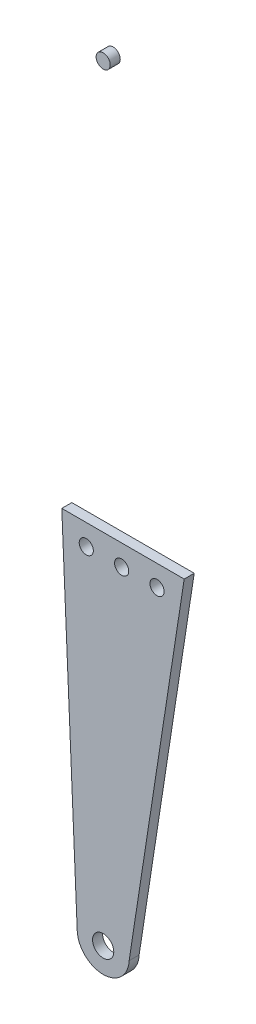
ISO-10303-21;
HEADER;
FILE_DESCRIPTION(('STEP AP214'),'2;1');
FILE_NAME('part.step','',(''),(''),'','','');
FILE_SCHEMA(('AUTOMOTIVE_DESIGN { 1 0 10303 214 1 1 1 1 }'));
ENDSEC;
DATA;
#1=APPLICATION_CONTEXT('core data for automotive mechanical design processes');
#2=APPLICATION_PROTOCOL_DEFINITION('international standard','automotive_design',2000,#1);
#3=PRODUCT_CONTEXT('',#1,'mechanical');
#4=PRODUCT('Part','Part','',(#3));
#5=PRODUCT_RELATED_PRODUCT_CATEGORY('part','',(#4));
#6=PRODUCT_DEFINITION_FORMATION('','',#4);
#7=PRODUCT_DEFINITION_CONTEXT('part definition',#1,'design');
#8=PRODUCT_DEFINITION('design','',#6,#7);
#9=PRODUCT_DEFINITION_SHAPE('','',#8);
#10=(LENGTH_UNIT() NAMED_UNIT(*) SI_UNIT(.MILLI.,.METRE.));
#11=(NAMED_UNIT(*) PLANE_ANGLE_UNIT() SI_UNIT($,.RADIAN.));
#12=(NAMED_UNIT(*) SI_UNIT($,.STERADIAN.) SOLID_ANGLE_UNIT());
#13=UNCERTAINTY_MEASURE_WITH_UNIT(LENGTH_MEASURE(1.E-05),#10,'distance_accuracy_value','');
#14=(GEOMETRIC_REPRESENTATION_CONTEXT(3) GLOBAL_UNCERTAINTY_ASSIGNED_CONTEXT((#13)) GLOBAL_UNIT_ASSIGNED_CONTEXT((#10,
#11,#12)) REPRESENTATION_CONTEXT('',''));
#15=CARTESIAN_POINT('',(0.,0.,0.));
#16=DIRECTION('',(0.,0.,1.));
#17=DIRECTION('',(1.,0.,0.));
#18=AXIS2_PLACEMENT_3D('',#15,#16,#17);
#19=CARTESIAN_POINT('',(58.9104803708938,262.917677391953,174.766033879968));
#20=DIRECTION('',(0.,0.,-1.));
#21=DIRECTION('',(-1.,0.,0.));
#22=AXIS2_PLACEMENT_3D('',#19,#20,#21);
#23=CYLINDRICAL_SURFACE('',#22,3.);
#24=CARTESIAN_POINT('',(58.9104803708938,262.917677391953,0.));
#25=DIRECTION('',(0.,0.,1.));
#26=DIRECTION('',(1.,0.,0.));
#27=AXIS2_PLACEMENT_3D('',#24,#25,#26);
#28=CIRCLE('',#27,3.);
#29=CARTESIAN_POINT('',(61.9104803708938,262.917677391953,0.));
#30=VERTEX_POINT('',#29);
#31=EDGE_CURVE('E48',#30,#30,#28,.T.);
#32=ORIENTED_EDGE('',*,*,#31,.T.);
#33=EDGE_LOOP('',(#32));
#34=FACE_BOUND('',#33,.T.);
#35=CARTESIAN_POINT('',(58.9104803708938,262.917677391953,4.25000000000003));
#36=DIRECTION('',(0.,0.,1.));
#37=DIRECTION('',(1.,0.,0.));
#38=AXIS2_PLACEMENT_3D('',#35,#36,#37);
#39=CIRCLE('',#38,3.);
#40=CARTESIAN_POINT('',(61.9104803708938,262.917677391953,4.25000000000003));
#41=VERTEX_POINT('',#40);
#42=EDGE_CURVE('E11',#41,#41,#39,.T.);
#43=ORIENTED_EDGE('',*,*,#42,.F.);
#44=EDGE_LOOP('',(#43));
#45=FACE_BOUND('',#44,.T.);
#46=ADVANCED_FACE('F41',(#34,#45),#23,.T.);
#47=CARTESIAN_POINT('',(58.9104803708938,262.917677391953,0.));
#48=DIRECTION('',(0.,0.,1.));
#49=DIRECTION('',(1.,0.,0.));
#50=AXIS2_PLACEMENT_3D('',#47,#48,#49);
#51=PLANE('',#50);
#52=ORIENTED_EDGE('',*,*,#31,.F.);
#53=EDGE_LOOP('',(#52));
#54=FACE_BOUND('',#53,.T.);
#55=ADVANCED_FACE('F56',(#54),#51,.F.);
#56=CARTESIAN_POINT('',(58.9104803708938,242.917677391945,4.25000000000003));
#57=DIRECTION('',(0.,0.,1.));
#58=DIRECTION('',(1.,0.,0.));
#59=AXIS2_PLACEMENT_3D('',#56,#57,#58);
#60=PLANE('',#59);
#61=ORIENTED_EDGE('',*,*,#42,.T.);
#62=EDGE_LOOP('',(#61));
#63=FACE_BOUND('',#62,.T.);
#64=ADVANCED_FACE('F43',(#63),#60,.T.);
#65=CLOSED_SHELL('',(#46,#55,#64));
#66=MANIFOLD_SOLID_BREP('B2',#65);
#67=CARTESIAN_POINT('',(93.2727340553119,89.8031267411093,174.766033879968));
#68=DIRECTION('',(-0.988376331409149,0.152027061769254,0.));
#69=DIRECTION('',(-0.152027061769254,-0.988376331409149,0.));
#70=AXIS2_PLACEMENT_3D('',#67,#68,#69);
#71=PLANE('',#70);
#72=DIRECTION('',(0.152027061769254,0.988376331409149,0.));
#73=VECTOR('',#72,1.);
#74=CARTESIAN_POINT('',(93.2727340553119,89.8031267411093,4.25000000000003));
#75=LINE('',#74,#73);
#76=CARTESIAN_POINT('',(69.9104803708938,-62.0823226080471,4.25000000000003));
#77=VERTEX_POINT('',#76);
#78=CARTESIAN_POINT('',(93.2727340553119,89.8031267411093,4.25000000000003));
#79=VERTEX_POINT('',#78);
#80=EDGE_CURVE('E126',#77,#79,#75,.T.);
#81=ORIENTED_EDGE('',*,*,#80,.F.);
#82=DIRECTION('',(0.,0.,-1.));
#83=VECTOR('',#82,1.);
#84=CARTESIAN_POINT('',(69.9104803708938,-62.0823226080471,174.766033879968));
#85=LINE('',#84,#83);
#86=CARTESIAN_POINT('',(69.9104803708938,-62.0823226080471,0.));
#87=VERTEX_POINT('',#86);
#88=EDGE_CURVE('E98',#77,#87,#85,.T.);
#89=ORIENTED_EDGE('',*,*,#88,.T.);
#90=DIRECTION('',(0.152027061769254,0.988376331409149,0.));
#91=VECTOR('',#90,1.);
#92=CARTESIAN_POINT('',(93.2727340553119,89.8031267411093,0.));
#93=LINE('',#92,#91);
#94=CARTESIAN_POINT('',(93.2727340553119,89.8031267411093,0.));
#95=VERTEX_POINT('',#94);
#96=EDGE_CURVE('E129',#87,#95,#93,.T.);
#97=ORIENTED_EDGE('',*,*,#96,.T.);
#98=DIRECTION('',(0.,0.,-1.));
#99=VECTOR('',#98,1.);
#100=CARTESIAN_POINT('',(93.2727340553119,89.8031267411093,174.766033879968));
#101=LINE('',#100,#99);
#102=EDGE_CURVE('E123',#79,#95,#101,.T.);
#103=ORIENTED_EDGE('',*,*,#102,.F.);
#104=EDGE_LOOP('',(#81,#89,#97,#103));
#105=FACE_BOUND('',#104,.T.);
#106=ADVANCED_FACE('F82',(#105),#71,.F.);
#107=CARTESIAN_POINT('',(58.9104803708938,-61.6078128041255,174.766033879968));
#108=DIRECTION('',(0.,0.,-1.));
#109=DIRECTION('',(-1.,0.,0.));
#110=AXIS2_PLACEMENT_3D('',#107,#108,#109);
#111=CYLINDRICAL_SURFACE('',#110,11.010229768448);
#112=CARTESIAN_POINT('',(58.9104803708938,-61.6078128041255,4.25000000000003));
#113=DIRECTION('',(0.,0.,1.));
#114=DIRECTION('',(1.,0.,0.));
#115=AXIS2_PLACEMENT_3D('',#112,#113,#114);
#116=CIRCLE('',#115,11.010229768448);
#117=CARTESIAN_POINT('',(47.9104803708938,-62.0823226080471,4.25000000000003));
#118=VERTEX_POINT('',#117);
#119=EDGE_CURVE('E140',#118,#77,#116,.T.);
#120=ORIENTED_EDGE('',*,*,#119,.F.);
#121=DIRECTION('',(0.,0.,-1.));
#122=VECTOR('',#121,1.);
#123=CARTESIAN_POINT('',(47.9104803708938,-62.0823226080471,174.766033879968));
#124=LINE('',#123,#122);
#125=CARTESIAN_POINT('',(47.9104803708938,-62.0823226080471,0.));
#126=VERTEX_POINT('',#125);
#127=EDGE_CURVE('E91',#118,#126,#124,.T.);
#128=ORIENTED_EDGE('',*,*,#127,.T.);
#129=CARTESIAN_POINT('',(58.9104803708938,-61.6078128041255,0.));
#130=DIRECTION('',(0.,0.,1.));
#131=DIRECTION('',(1.,0.,0.));
#132=AXIS2_PLACEMENT_3D('',#129,#130,#131);
#133=CIRCLE('',#132,11.010229768448);
#134=EDGE_CURVE('E156',#126,#87,#133,.T.);
#135=ORIENTED_EDGE('',*,*,#134,.T.);
#136=ORIENTED_EDGE('',*,*,#88,.F.);
#137=EDGE_LOOP('',(#120,#128,#135,#136));
#138=FACE_BOUND('',#137,.T.);
#139=ADVANCED_FACE('F160',(#138),#111,.T.);
#140=CARTESIAN_POINT('',(41.3585590264204,89.8031267411093,174.766033879968));
#141=DIRECTION('',(0.999070885107477,0.043097175436009,0.));
#142=DIRECTION('',(-0.043097175436009,0.999070885107477,0.));
#143=AXIS2_PLACEMENT_3D('',#140,#141,#142);
#144=PLANE('',#143);
#145=DIRECTION('',(0.043097175436009,-0.999070885107477,0.));
#146=VECTOR('',#145,1.);
#147=CARTESIAN_POINT('',(41.3585590264204,89.8031267411093,4.25000000000003));
#148=LINE('',#147,#146);
#149=CARTESIAN_POINT('',(41.3585590264204,89.8031267411093,4.25000000000003));
#150=VERTEX_POINT('',#149);
#151=EDGE_CURVE('E105',#150,#118,#148,.T.);
#152=ORIENTED_EDGE('',*,*,#151,.F.);
#153=DIRECTION('',(0.,0.,-1.));
#154=VECTOR('',#153,1.);
#155=CARTESIAN_POINT('',(41.3585590264204,89.8031267411093,174.766033879968));
#156=LINE('',#155,#154);
#157=CARTESIAN_POINT('',(41.3585590264204,89.8031267411093,0.));
#158=VERTEX_POINT('',#157);
#159=EDGE_CURVE('E39',#150,#158,#156,.T.);
#160=ORIENTED_EDGE('',*,*,#159,.T.);
#161=DIRECTION('',(0.043097175436009,-0.999070885107477,0.));
#162=VECTOR('',#161,1.);
#163=CARTESIAN_POINT('',(41.3585590264204,89.8031267411093,0.));
#164=LINE('',#163,#162);
#165=EDGE_CURVE('E153',#158,#126,#164,.T.);
#166=ORIENTED_EDGE('',*,*,#165,.T.);
#167=ORIENTED_EDGE('',*,*,#127,.F.);
#168=EDGE_LOOP('',(#152,#160,#166,#167));
#169=FACE_BOUND('',#168,.T.);
#170=ADVANCED_FACE('F163',(#169),#144,.F.);
#171=CARTESIAN_POINT('',(41.3585590264204,89.8031267411093,174.766033879968));
#172=DIRECTION('',(0.,-1.,0.));
#173=DIRECTION('',(0.,0.,-1.));
#174=AXIS2_PLACEMENT_3D('',#171,#172,#173);
#175=PLANE('',#174);
#176=DIRECTION('',(-1.,0.,0.));
#177=VECTOR('',#176,1.);
#178=CARTESIAN_POINT('',(41.3585590264204,89.8031267411093,4.25000000000003));
#179=LINE('',#178,#177);
#180=EDGE_CURVE('E135',#79,#150,#179,.T.);
#181=ORIENTED_EDGE('',*,*,#180,.F.);
#182=ORIENTED_EDGE('',*,*,#102,.T.);
#183=DIRECTION('',(-1.,0.,0.));
#184=VECTOR('',#183,1.);
#185=CARTESIAN_POINT('',(41.3585590264204,89.8031267411093,0.));
#186=LINE('',#185,#184);
#187=EDGE_CURVE('E151',#95,#158,#186,.T.);
#188=ORIENTED_EDGE('',*,*,#187,.T.);
#189=ORIENTED_EDGE('',*,*,#159,.F.);
#190=EDGE_LOOP('',(#181,#182,#188,#189));
#191=FACE_BOUND('',#190,.T.);
#192=ADVANCED_FACE('F84',(#191),#175,.F.);
#193=CARTESIAN_POINT('',(58.9104803708938,-61.6078128041255,0.));
#194=DIRECTION('',(0.,0.,1.));
#195=DIRECTION('',(1.,0.,0.));
#196=AXIS2_PLACEMENT_3D('',#193,#194,#195);
#197=PLANE('',#196);
#198=CARTESIAN_POINT('',(51.7511527094115,80.9176773919431,0.));
#199=DIRECTION('',(0.,0.,1.));
#200=DIRECTION('',(1.,0.,0.));
#201=AXIS2_PLACEMENT_3D('',#198,#199,#200);
#202=CIRCLE('',#201,3.);
#203=CARTESIAN_POINT('',(54.7511527094115,80.9176773919431,0.));
#204=VERTEX_POINT('',#203);
#205=EDGE_CURVE('E144',#204,#204,#202,.T.);
#206=ORIENTED_EDGE('',*,*,#205,.T.);
#207=EDGE_LOOP('',(#206));
#208=FACE_BOUND('',#207,.T.);
#209=CARTESIAN_POINT('',(66.7511527094115,80.9176773919431,0.));
#210=DIRECTION('',(0.,0.,1.));
#211=DIRECTION('',(1.,0.,0.));
#212=AXIS2_PLACEMENT_3D('',#209,#210,#211);
#213=CIRCLE('',#212,2.99999999999999);
#214=CARTESIAN_POINT('',(69.7511527094115,80.9176773919431,0.));
#215=VERTEX_POINT('',#214);
#216=EDGE_CURVE('E250',#215,#215,#213,.T.);
#217=ORIENTED_EDGE('',*,*,#216,.T.);
#218=EDGE_LOOP('',(#217));
#219=FACE_BOUND('',#218,.T.);
#220=CARTESIAN_POINT('',(81.7511527094115,80.9176773919431,0.));
#221=DIRECTION('',(0.,0.,1.));
#222=DIRECTION('',(1.,0.,0.));
#223=AXIS2_PLACEMENT_3D('',#220,#221,#222);
#224=CIRCLE('',#223,3.00000000000001);
#225=CARTESIAN_POINT('',(84.7511527094115,80.9176773919431,0.));
#226=VERTEX_POINT('',#225);
#227=EDGE_CURVE('E252',#226,#226,#224,.T.);
#228=ORIENTED_EDGE('',*,*,#227,.T.);
#229=EDGE_LOOP('',(#228));
#230=FACE_BOUND('',#229,.T.);
#231=ORIENTED_EDGE('',*,*,#187,.F.);
#232=ORIENTED_EDGE('',*,*,#96,.F.);
#233=ORIENTED_EDGE('',*,*,#134,.F.);
#234=ORIENTED_EDGE('',*,*,#165,.F.);
#235=EDGE_LOOP('',(#231,#232,#233,#234));
#236=FACE_BOUND('',#235,.T.);
#237=CARTESIAN_POINT('',(58.9104803708938,-62.0823226080471,0.));
#238=DIRECTION('',(0.,0.,1.));
#239=DIRECTION('',(1.,0.,0.));
#240=AXIS2_PLACEMENT_3D('',#237,#238,#239);
#241=CIRCLE('',#240,4.50000000000001);
#242=CARTESIAN_POINT('',(63.4104803708938,-62.0823226080471,0.));
#243=VERTEX_POINT('',#242);
#244=EDGE_CURVE('E137',#243,#243,#241,.T.);
#245=ORIENTED_EDGE('',*,*,#244,.T.);
#246=EDGE_LOOP('',(#245));
#247=FACE_BOUND('',#246,.T.);
#248=ADVANCED_FACE('F165',(#208,#219,#230,#236,#247),#197,.F.);
#249=CARTESIAN_POINT('',(58.9104803708938,-62.0823226080471,174.766033879968));
#250=DIRECTION('',(0.,0.,-1.));
#251=DIRECTION('',(-1.,0.,0.));
#252=AXIS2_PLACEMENT_3D('',#249,#250,#251);
#253=CYLINDRICAL_SURFACE('',#252,4.50000000000001);
#254=ORIENTED_EDGE('',*,*,#244,.F.);
#255=EDGE_LOOP('',(#254));
#256=FACE_BOUND('',#255,.T.);
#257=CARTESIAN_POINT('',(58.9104803708938,-62.0823226080471,4.25000000000003));
#258=DIRECTION('',(0.,0.,1.));
#259=DIRECTION('',(1.,0.,0.));
#260=AXIS2_PLACEMENT_3D('',#257,#258,#259);
#261=CIRCLE('',#260,4.50000000000001);
#262=CARTESIAN_POINT('',(63.4104803708938,-62.0823226080471,4.25000000000003));
#263=VERTEX_POINT('',#262);
#264=EDGE_CURVE('E86',#263,#263,#261,.T.);
#265=ORIENTED_EDGE('',*,*,#264,.T.);
#266=EDGE_LOOP('',(#265));
#267=FACE_BOUND('',#266,.T.);
#268=ADVANCED_FACE('F168',(#256,#267),#253,.F.);
#269=CARTESIAN_POINT('',(58.9104803708938,242.917677391945,4.25000000000003));
#270=DIRECTION('',(0.,0.,1.));
#271=DIRECTION('',(1.,0.,0.));
#272=AXIS2_PLACEMENT_3D('',#269,#270,#271);
#273=PLANE('',#272);
#274=CARTESIAN_POINT('',(51.7511527094115,80.9176773919431,4.25000000000003));
#275=DIRECTION('',(0.,0.,1.));
#276=DIRECTION('',(1.,0.,0.));
#277=AXIS2_PLACEMENT_3D('',#274,#275,#276);
#278=CIRCLE('',#277,3.);
#279=CARTESIAN_POINT('',(54.7511527094115,80.9176773919431,4.25000000000003));
#280=VERTEX_POINT('',#279);
#281=EDGE_CURVE('E247',#280,#280,#278,.T.);
#282=ORIENTED_EDGE('',*,*,#281,.F.);
#283=EDGE_LOOP('',(#282));
#284=FACE_BOUND('',#283,.T.);
#285=CARTESIAN_POINT('',(66.7511527094115,80.9176773919431,4.25000000000003));
#286=DIRECTION('',(0.,0.,1.));
#287=DIRECTION('',(1.,0.,0.));
#288=AXIS2_PLACEMENT_3D('',#285,#286,#287);
#289=CIRCLE('',#288,2.99999999999999);
#290=CARTESIAN_POINT('',(69.7511527094115,80.9176773919431,4.25000000000003));
#291=VERTEX_POINT('',#290);
#292=EDGE_CURVE('E261',#291,#291,#289,.T.);
#293=ORIENTED_EDGE('',*,*,#292,.F.);
#294=EDGE_LOOP('',(#293));
#295=FACE_BOUND('',#294,.T.);
#296=CARTESIAN_POINT('',(81.7511527094115,80.9176773919431,4.25000000000003));
#297=DIRECTION('',(0.,0.,1.));
#298=DIRECTION('',(1.,0.,0.));
#299=AXIS2_PLACEMENT_3D('',#296,#297,#298);
#300=CIRCLE('',#299,3.00000000000001);
#301=CARTESIAN_POINT('',(84.7511527094115,80.9176773919431,4.25000000000003));
#302=VERTEX_POINT('',#301);
#303=EDGE_CURVE('E258',#302,#302,#300,.T.);
#304=ORIENTED_EDGE('',*,*,#303,.F.);
#305=EDGE_LOOP('',(#304));
#306=FACE_BOUND('',#305,.T.);
#307=ORIENTED_EDGE('',*,*,#264,.F.);
#308=EDGE_LOOP('',(#307));
#309=FACE_BOUND('',#308,.T.);
#310=ORIENTED_EDGE('',*,*,#80,.T.);
#311=ORIENTED_EDGE('',*,*,#180,.T.);
#312=ORIENTED_EDGE('',*,*,#151,.T.);
#313=ORIENTED_EDGE('',*,*,#119,.T.);
#314=EDGE_LOOP('',(#310,#311,#312,#313));
#315=FACE_BOUND('',#314,.T.);
#316=ADVANCED_FACE('F139',(#284,#295,#306,#309,#315),#273,.T.);
#317=CARTESIAN_POINT('',(81.7511527094115,80.9176773919431,-5.74999999999997));
#318=DIRECTION('',(0.,0.,1.));
#319=DIRECTION('',(1.,0.,0.));
#320=AXIS2_PLACEMENT_3D('',#317,#318,#319);
#321=CYLINDRICAL_SURFACE('',#320,3.00000000000001);
#322=ORIENTED_EDGE('',*,*,#303,.T.);
#323=EDGE_LOOP('',(#322));
#324=FACE_BOUND('',#323,.T.);
#325=ORIENTED_EDGE('',*,*,#227,.F.);
#326=EDGE_LOOP('',(#325));
#327=FACE_BOUND('',#326,.T.);
#328=ADVANCED_FACE('F179',(#324,#327),#321,.F.);
#329=CARTESIAN_POINT('',(66.7511527094115,80.9176773919431,-5.74999999999997));
#330=DIRECTION('',(0.,0.,1.));
#331=DIRECTION('',(1.,0.,0.));
#332=AXIS2_PLACEMENT_3D('',#329,#330,#331);
#333=CYLINDRICAL_SURFACE('',#332,2.99999999999999);
#334=ORIENTED_EDGE('',*,*,#292,.T.);
#335=EDGE_LOOP('',(#334));
#336=FACE_BOUND('',#335,.T.);
#337=ORIENTED_EDGE('',*,*,#216,.F.);
#338=EDGE_LOOP('',(#337));
#339=FACE_BOUND('',#338,.T.);
#340=ADVANCED_FACE('F185',(#336,#339),#333,.F.);
#341=CARTESIAN_POINT('',(51.7511527094115,80.9176773919431,-5.74999999999997));
#342=DIRECTION('',(0.,0.,1.));
#343=DIRECTION('',(1.,0.,0.));
#344=AXIS2_PLACEMENT_3D('',#341,#342,#343);
#345=CYLINDRICAL_SURFACE('',#344,3.);
#346=ORIENTED_EDGE('',*,*,#281,.T.);
#347=EDGE_LOOP('',(#346));
#348=FACE_BOUND('',#347,.T.);
#349=ORIENTED_EDGE('',*,*,#205,.F.);
#350=EDGE_LOOP('',(#349));
#351=FACE_BOUND('',#350,.T.);
#352=ADVANCED_FACE('F231',(#348,#351),#345,.F.);
#353=CLOSED_SHELL('',(#106,#139,#170,#192,#248,#268,#316,#328,#340,#352));
#354=MANIFOLD_SOLID_BREP('B6',#353);
#355=ADVANCED_BREP_SHAPE_REPRESENTATION('',(#18,#66,#354),#14);
#356=SHAPE_DEFINITION_REPRESENTATION(#9,#355);
ENDSEC;
END-ISO-10303-21;
